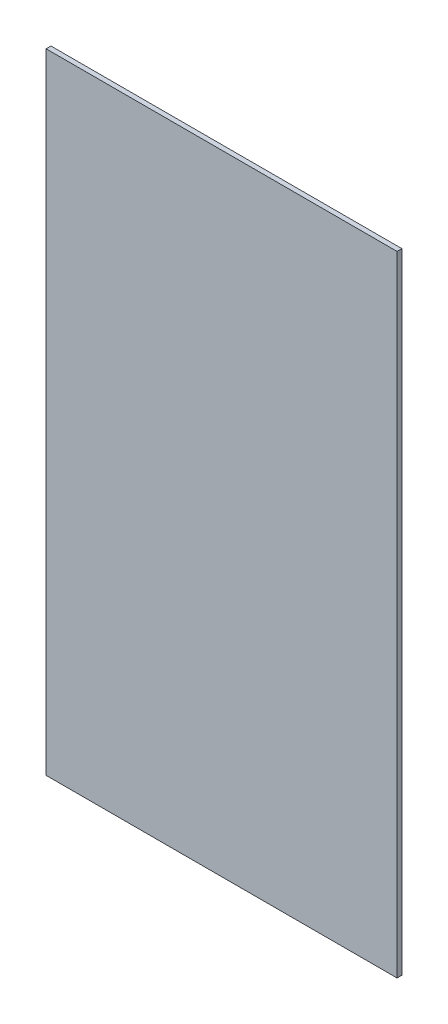
ISO-10303-21;
HEADER;
FILE_DESCRIPTION(('STEP AP214'),'2;1');
FILE_NAME('part.step','',(''),(''),'','','');
FILE_SCHEMA(('AUTOMOTIVE_DESIGN { 1 0 10303 214 1 1 1 1 }'));
ENDSEC;
DATA;
#1=APPLICATION_CONTEXT('core data for automotive mechanical design processes');
#2=APPLICATION_PROTOCOL_DEFINITION('international standard','automotive_design',2000,#1);
#3=PRODUCT_CONTEXT('',#1,'mechanical');
#4=PRODUCT('Part','Part','',(#3));
#5=PRODUCT_RELATED_PRODUCT_CATEGORY('part','',(#4));
#6=PRODUCT_DEFINITION_FORMATION('','',#4);
#7=PRODUCT_DEFINITION_CONTEXT('part definition',#1,'design');
#8=PRODUCT_DEFINITION('design','',#6,#7);
#9=PRODUCT_DEFINITION_SHAPE('','',#8);
#10=(LENGTH_UNIT() NAMED_UNIT(*) SI_UNIT(.MILLI.,.METRE.));
#11=(NAMED_UNIT(*) PLANE_ANGLE_UNIT() SI_UNIT($,.RADIAN.));
#12=(NAMED_UNIT(*) SI_UNIT($,.STERADIAN.) SOLID_ANGLE_UNIT());
#13=UNCERTAINTY_MEASURE_WITH_UNIT(LENGTH_MEASURE(1.E-05),#10,'distance_accuracy_value','');
#14=(GEOMETRIC_REPRESENTATION_CONTEXT(3) GLOBAL_UNCERTAINTY_ASSIGNED_CONTEXT((#13)) GLOBAL_UNIT_ASSIGNED_CONTEXT((#10,
#11,#12)) REPRESENTATION_CONTEXT('',''));
#15=CARTESIAN_POINT('',(0.,0.,0.));
#16=DIRECTION('',(0.,0.,1.));
#17=DIRECTION('',(1.,0.,0.));
#18=AXIS2_PLACEMENT_3D('',#15,#16,#17);
#19=CARTESIAN_POINT('',(-19.2733943507042,50.133696912704,0.127000000000051));
#20=DIRECTION('',(1.,0.,0.));
#21=DIRECTION('',(0.,0.,-1.));
#22=AXIS2_PLACEMENT_3D('',#19,#20,#21);
#23=PLANE('',#22);
#24=DIRECTION('',(0.,-1.00000000000001,0.));
#25=VECTOR('',#24,1.);
#26=CARTESIAN_POINT('',(-19.2733943507042,50.133696912704,0.));
#27=LINE('',#26,#25);
#28=CARTESIAN_POINT('',(-19.2733943507042,50.133696912704,0.));
#29=VERTEX_POINT('',#28);
#30=CARTESIAN_POINT('',(-19.2733943507042,33.6236969127041,0.));
#31=VERTEX_POINT('',#30);
#32=EDGE_CURVE('E98',#29,#31,#27,.T.);
#33=ORIENTED_EDGE('',*,*,#32,.T.);
#34=DIRECTION('',(0.,0.,-1.));
#35=VECTOR('',#34,1.);
#36=CARTESIAN_POINT('',(-19.2733943507042,33.6236969127041,0.12700000000003));
#37=LINE('',#36,#35);
#38=CARTESIAN_POINT('',(-19.2733943507042,33.6236969127041,0.12700000000003));
#39=VERTEX_POINT('',#38);
#40=EDGE_CURVE('E11',#39,#31,#37,.T.);
#41=ORIENTED_EDGE('',*,*,#40,.F.);
#42=DIRECTION('',(0.,-1.00000000000001,0.));
#43=VECTOR('',#42,1.);
#44=CARTESIAN_POINT('',(-19.2733943507042,50.133696912704,0.127000000000051));
#45=LINE('',#44,#43);
#46=CARTESIAN_POINT('',(-19.2733943507042,50.133696912704,0.127000000000051));
#47=VERTEX_POINT('',#46);
#48=EDGE_CURVE('E86',#47,#39,#45,.T.);
#49=ORIENTED_EDGE('',*,*,#48,.F.);
#50=DIRECTION('',(0.,0.,-1.));
#51=VECTOR('',#50,1.);
#52=CARTESIAN_POINT('',(-19.2733943507042,50.133696912704,0.127000000000051));
#53=LINE('',#52,#51);
#54=EDGE_CURVE('E94',#47,#29,#53,.T.);
#55=ORIENTED_EDGE('',*,*,#54,.T.);
#56=EDGE_LOOP('',(#33,#41,#49,#55));
#57=FACE_BOUND('',#56,.T.);
#58=ADVANCED_FACE('F35',(#57),#23,.F.);
#59=CARTESIAN_POINT('',(-19.2733943507042,33.6236969127041,0.12700000000003));
#60=DIRECTION('',(0.,1.00000000000001,0.));
#61=DIRECTION('',(0.,0.,1.));
#62=AXIS2_PLACEMENT_3D('',#59,#60,#61);
#63=PLANE('',#62);
#64=DIRECTION('',(1.,0.,0.));
#65=VECTOR('',#64,1.);
#66=CARTESIAN_POINT('',(-19.2733943507042,33.6236969127041,0.));
#67=LINE('',#66,#65);
#68=CARTESIAN_POINT('',(-10.0658943507042,33.623696912704,0.));
#69=VERTEX_POINT('',#68);
#70=EDGE_CURVE('E90',#31,#69,#67,.T.);
#71=ORIENTED_EDGE('',*,*,#70,.T.);
#72=DIRECTION('',(0.,0.,-1.));
#73=VECTOR('',#72,1.);
#74=CARTESIAN_POINT('',(-10.0658943507042,33.623696912704,0.12700000000003));
#75=LINE('',#74,#73);
#76=CARTESIAN_POINT('',(-10.0658943507042,33.623696912704,0.12700000000003));
#77=VERTEX_POINT('',#76);
#78=EDGE_CURVE('E43',#77,#69,#75,.T.);
#79=ORIENTED_EDGE('',*,*,#78,.F.);
#80=DIRECTION('',(1.,0.,0.));
#81=VECTOR('',#80,1.);
#82=CARTESIAN_POINT('',(-19.2733943507042,33.6236969127041,0.12700000000003));
#83=LINE('',#82,#81);
#84=EDGE_CURVE('E81',#39,#77,#83,.T.);
#85=ORIENTED_EDGE('',*,*,#84,.F.);
#86=ORIENTED_EDGE('',*,*,#40,.T.);
#87=EDGE_LOOP('',(#71,#79,#85,#86));
#88=FACE_BOUND('',#87,.T.);
#89=ADVANCED_FACE('F89',(#88),#63,.F.);
#90=CARTESIAN_POINT('',(-10.0658943507042,33.623696912704,0.12700000000003));
#91=DIRECTION('',(-1.,0.,0.));
#92=DIRECTION('',(0.,-1.00000000000001,0.));
#93=AXIS2_PLACEMENT_3D('',#90,#91,#92);
#94=PLANE('',#93);
#95=DIRECTION('',(0.,1.00000000000001,0.));
#96=VECTOR('',#95,1.);
#97=CARTESIAN_POINT('',(-10.0658943507042,33.623696912704,0.));
#98=LINE('',#97,#96);
#99=CARTESIAN_POINT('',(-10.0658943507042,50.133696912704,0.));
#100=VERTEX_POINT('',#99);
#101=EDGE_CURVE('E68',#69,#100,#98,.T.);
#102=ORIENTED_EDGE('',*,*,#101,.T.);
#103=DIRECTION('',(0.,0.,-1.));
#104=VECTOR('',#103,1.);
#105=CARTESIAN_POINT('',(-10.0658943507042,50.133696912704,0.127000000000051));
#106=LINE('',#105,#104);
#107=CARTESIAN_POINT('',(-10.0658943507042,50.133696912704,0.127000000000051));
#108=VERTEX_POINT('',#107);
#109=EDGE_CURVE('E91',#108,#100,#106,.T.);
#110=ORIENTED_EDGE('',*,*,#109,.F.);
#111=DIRECTION('',(0.,1.00000000000001,0.));
#112=VECTOR('',#111,1.);
#113=CARTESIAN_POINT('',(-10.0658943507042,33.623696912704,0.12700000000003));
#114=LINE('',#113,#112);
#115=EDGE_CURVE('E84',#77,#108,#114,.T.);
#116=ORIENTED_EDGE('',*,*,#115,.F.);
#117=ORIENTED_EDGE('',*,*,#78,.T.);
#118=EDGE_LOOP('',(#102,#110,#116,#117));
#119=FACE_BOUND('',#118,.T.);
#120=ADVANCED_FACE('F92',(#119),#94,.F.);
#121=CARTESIAN_POINT('',(-10.0658943507042,50.133696912704,0.127000000000051));
#122=DIRECTION('',(0.,-1.00000000000001,0.));
#123=DIRECTION('',(0.,0.,-1.));
#124=AXIS2_PLACEMENT_3D('',#121,#122,#123);
#125=PLANE('',#124);
#126=DIRECTION('',(-1.,0.,0.));
#127=VECTOR('',#126,1.);
#128=CARTESIAN_POINT('',(-10.0658943507042,50.133696912704,0.));
#129=LINE('',#128,#127);
#130=EDGE_CURVE('E74',#100,#29,#129,.T.);
#131=ORIENTED_EDGE('',*,*,#130,.T.);
#132=ORIENTED_EDGE('',*,*,#54,.F.);
#133=DIRECTION('',(-1.,0.,0.));
#134=VECTOR('',#133,1.);
#135=CARTESIAN_POINT('',(-10.0658943507042,50.133696912704,0.127000000000051));
#136=LINE('',#135,#134);
#137=EDGE_CURVE('E51',#108,#47,#136,.T.);
#138=ORIENTED_EDGE('',*,*,#137,.F.);
#139=ORIENTED_EDGE('',*,*,#109,.T.);
#140=EDGE_LOOP('',(#131,#132,#138,#139));
#141=FACE_BOUND('',#140,.T.);
#142=ADVANCED_FACE('F105',(#141),#125,.F.);
#143=CARTESIAN_POINT('',(0.,0.,0.127000000000002));
#144=DIRECTION('',(0.,0.,1.));
#145=DIRECTION('',(1.,0.,0.));
#146=AXIS2_PLACEMENT_3D('',#143,#144,#145);
#147=PLANE('',#146);
#148=ORIENTED_EDGE('',*,*,#48,.T.);
#149=ORIENTED_EDGE('',*,*,#84,.T.);
#150=ORIENTED_EDGE('',*,*,#115,.T.);
#151=ORIENTED_EDGE('',*,*,#137,.T.);
#152=EDGE_LOOP('',(#148,#149,#150,#151));
#153=FACE_BOUND('',#152,.T.);
#154=ADVANCED_FACE('F82',(#153),#147,.T.);
#155=CARTESIAN_POINT('',(0.,0.,0.));
#156=DIRECTION('',(0.,0.,1.));
#157=DIRECTION('',(1.,0.,0.));
#158=AXIS2_PLACEMENT_3D('',#155,#156,#157);
#159=PLANE('',#158);
#160=ORIENTED_EDGE('',*,*,#32,.F.);
#161=ORIENTED_EDGE('',*,*,#130,.F.);
#162=ORIENTED_EDGE('',*,*,#101,.F.);
#163=ORIENTED_EDGE('',*,*,#70,.F.);
#164=EDGE_LOOP('',(#160,#161,#162,#163));
#165=FACE_BOUND('',#164,.T.);
#166=ADVANCED_FACE('F108',(#165),#159,.F.);
#167=CLOSED_SHELL('',(#58,#89,#120,#142,#154,#166));
#168=MANIFOLD_SOLID_BREP('B2',#167);
#169=ADVANCED_BREP_SHAPE_REPRESENTATION('',(#18,#168),#14);
#170=SHAPE_DEFINITION_REPRESENTATION(#9,#169);
ENDSEC;
END-ISO-10303-21;
